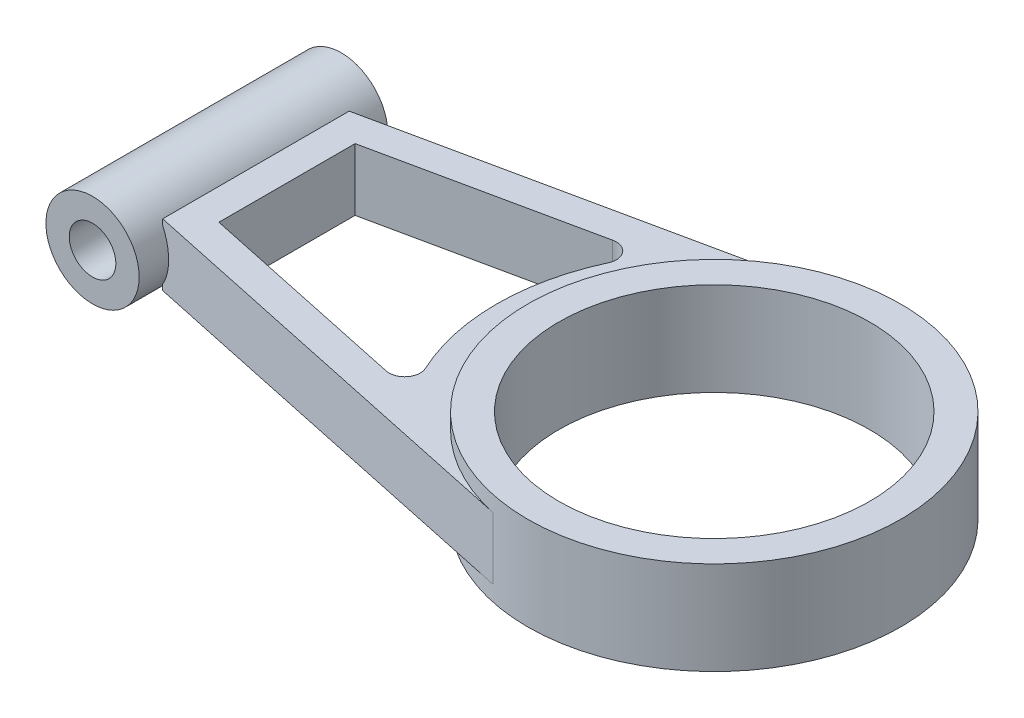
ISO-10303-21;
HEADER;
FILE_DESCRIPTION(('STEP AP214'),'2;1');
FILE_NAME('part.step','',(''),(''),'','','');
FILE_SCHEMA(('AUTOMOTIVE_DESIGN { 1 0 10303 214 1 1 1 1 }'));
ENDSEC;
DATA;
#1=APPLICATION_CONTEXT('core data for automotive mechanical design processes');
#2=APPLICATION_PROTOCOL_DEFINITION('international standard','automotive_design',2000,#1);
#3=PRODUCT_CONTEXT('',#1,'mechanical');
#4=PRODUCT('Part','Part','',(#3));
#5=PRODUCT_RELATED_PRODUCT_CATEGORY('part','',(#4));
#6=PRODUCT_DEFINITION_FORMATION('','',#4);
#7=PRODUCT_DEFINITION_CONTEXT('part definition',#1,'design');
#8=PRODUCT_DEFINITION('design','',#6,#7);
#9=PRODUCT_DEFINITION_SHAPE('','',#8);
#10=(LENGTH_UNIT() NAMED_UNIT(*) SI_UNIT(.MILLI.,.METRE.));
#11=(NAMED_UNIT(*) PLANE_ANGLE_UNIT() SI_UNIT($,.RADIAN.));
#12=(NAMED_UNIT(*) SI_UNIT($,.STERADIAN.) SOLID_ANGLE_UNIT());
#13=UNCERTAINTY_MEASURE_WITH_UNIT(LENGTH_MEASURE(1.E-05),#10,'distance_accuracy_value','');
#14=(GEOMETRIC_REPRESENTATION_CONTEXT(3) GLOBAL_UNCERTAINTY_ASSIGNED_CONTEXT((#13)) GLOBAL_UNIT_ASSIGNED_CONTEXT((#10,
#11,#12)) REPRESENTATION_CONTEXT('',''));
#15=CARTESIAN_POINT('',(0.,0.,0.));
#16=DIRECTION('',(0.,0.,1.));
#17=DIRECTION('',(1.,0.,0.));
#18=AXIS2_PLACEMENT_3D('',#15,#16,#17);
#19=CARTESIAN_POINT('',(-147.445157400294,30.,-30.));
#20=DIRECTION('',(1.,0.,0.));
#21=DIRECTION('',(0.,0.,-1.));
#22=AXIS2_PLACEMENT_3D('',#19,#20,#21);
#23=PLANE('',#22);
#24=DIRECTION('',(0.,-1.,0.));
#25=VECTOR('',#24,1.);
#26=CARTESIAN_POINT('',(-147.445157400294,30.,-30.));
#27=LINE('',#26,#25);
#28=CARTESIAN_POINT('',(-147.445157400294,25.,-30.));
#29=VERTEX_POINT('',#28);
#30=CARTESIAN_POINT('',(-147.445157400294,23.2082840652967,-30.));
#31=VERTEX_POINT('',#30);
#32=EDGE_CURVE('E163',#29,#31,#27,.T.);
#33=ORIENTED_EDGE('',*,*,#32,.T.);
#34=DIRECTION('',(0.,0.,-1.));
#35=VECTOR('',#34,1.);
#36=CARTESIAN_POINT('',(-147.445157400294,23.2082840652967,40.));
#37=LINE('',#36,#35);
#38=CARTESIAN_POINT('',(-147.445157400294,23.2082840652967,30.));
#39=VERTEX_POINT('',#38);
#40=EDGE_CURVE('E144',#39,#31,#37,.T.);
#41=ORIENTED_EDGE('',*,*,#40,.F.);
#42=DIRECTION('',(0.,-1.,0.));
#43=VECTOR('',#42,1.);
#44=CARTESIAN_POINT('',(-147.445157400294,30.,30.));
#45=LINE('',#44,#43);
#46=CARTESIAN_POINT('',(-147.445157400294,25.,30.));
#47=VERTEX_POINT('',#46);
#48=EDGE_CURVE('E164',#47,#39,#45,.T.);
#49=ORIENTED_EDGE('',*,*,#48,.F.);
#50=DIRECTION('',(0.,0.,1.));
#51=VECTOR('',#50,1.);
#52=CARTESIAN_POINT('',(-147.445157400294,25.,-30.));
#53=LINE('',#52,#51);
#54=EDGE_CURVE('E68',#29,#47,#53,.T.);
#55=ORIENTED_EDGE('',*,*,#54,.F.);
#56=EDGE_LOOP('',(#33,#41,#49,#55));
#57=FACE_BOUND('',#56,.T.);
#58=ADVANCED_FACE('F45',(#57),#23,.F.);
#59=DIRECTION('',(0.,0.,-1.));
#60=VECTOR('',#59,1.);
#61=CARTESIAN_POINT('',(-147.445157400294,6.79171593470326,40.));
#62=LINE('',#61,#60);
#63=CARTESIAN_POINT('',(-147.445157400294,6.79171593470327,-30.));
#64=VERTEX_POINT('',#63);
#65=CARTESIAN_POINT('',(-147.445157400294,6.79171593470328,30.));
#66=VERTEX_POINT('',#65);
#67=EDGE_CURVE('E133',#64,#66,#62,.F.);
#68=ORIENTED_EDGE('',*,*,#67,.F.);
#69=CARTESIAN_POINT('',(-147.445157400294,5.,-30.));
#70=VERTEX_POINT('',#69);
#71=EDGE_CURVE('E138',#64,#70,#27,.T.);
#72=ORIENTED_EDGE('',*,*,#71,.T.);
#73=DIRECTION('',(0.,0.,1.));
#74=VECTOR('',#73,1.);
#75=CARTESIAN_POINT('',(-147.445157400294,5.,-30.));
#76=LINE('',#75,#74);
#77=CARTESIAN_POINT('',(-147.445157400294,5.,30.));
#78=VERTEX_POINT('',#77);
#79=EDGE_CURVE('E191',#70,#78,#76,.T.);
#80=ORIENTED_EDGE('',*,*,#79,.T.);
#81=EDGE_CURVE('E140',#66,#78,#45,.T.);
#82=ORIENTED_EDGE('',*,*,#81,.F.);
#83=EDGE_LOOP('',(#68,#72,#80,#82));
#84=FACE_BOUND('',#83,.T.);
#85=ADVANCED_FACE('F135',(#84),#23,.F.);
#86=CARTESIAN_POINT('',(-147.445157400294,30.,-30.));
#87=DIRECTION('',(0.20791169081776,0.,0.978147600733806));
#88=DIRECTION('',(0.978147600733806,0.,-0.20791169081776));
#89=AXIS2_PLACEMENT_3D('',#86,#87,#88);
#90=PLANE('',#89);
#91=ORIENTED_EDGE('',*,*,#71,.F.);
#92=CARTESIAN_POINT('',(-160.,15.,-27.3313858246981));
#93=DIRECTION('',(0.20791169081776,0.,0.978147600733806));
#94=DIRECTION('',(-0.978147600733806,0.,0.20791169081776));
#95=AXIS2_PLACEMENT_3D('',#92,#93,#94);
#96=ELLIPSE('',#95,15.3351089229755,15.);
#97=EDGE_CURVE('E147',#64,#31,#96,.T.);
#98=ORIENTED_EDGE('',*,*,#97,.T.);
#99=ORIENTED_EDGE('',*,*,#32,.F.);
#100=DIRECTION('',(-0.978147600733805,0.,0.20791169081776));
#101=VECTOR('',#100,1.);
#102=CARTESIAN_POINT('',(-12.4747014490656,25.,-58.6888560440283));
#103=LINE('',#102,#101);
#104=CARTESIAN_POINT('',(-12.4747014490656,25.,-58.6888560440283));
#105=VERTEX_POINT('',#104);
#106=EDGE_CURVE('E175',#105,#29,#103,.T.);
#107=ORIENTED_EDGE('',*,*,#106,.F.);
#108=DIRECTION('',(0.,-1.,0.));
#109=VECTOR('',#108,1.);
#110=CARTESIAN_POINT('',(-12.4747014490656,30.,-58.6888560440283));
#111=LINE('',#110,#109);
#112=CARTESIAN_POINT('',(-12.4747014490656,5.,-58.6888560440283));
#113=VERTEX_POINT('',#112);
#114=EDGE_CURVE('E55',#105,#113,#111,.T.);
#115=ORIENTED_EDGE('',*,*,#114,.T.);
#116=DIRECTION('',(-0.978147600733805,0.,0.20791169081776));
#117=VECTOR('',#116,1.);
#118=CARTESIAN_POINT('',(-12.4747014490656,5.,-58.6888560440283));
#119=LINE('',#118,#117);
#120=EDGE_CURVE('E161',#113,#70,#119,.T.);
#121=ORIENTED_EDGE('',*,*,#120,.T.);
#122=EDGE_LOOP('',(#91,#98,#99,#107,#115,#121));
#123=FACE_BOUND('',#122,.T.);
#124=ADVANCED_FACE('F159',(#123),#90,.F.);
#125=CARTESIAN_POINT('',(-147.445157400294,30.,30.));
#126=DIRECTION('',(0.20791169081776,0.,-0.978147600733806));
#127=DIRECTION('',(-0.978147600733806,0.,-0.20791169081776));
#128=AXIS2_PLACEMENT_3D('',#125,#126,#127);
#129=PLANE('',#128);
#130=CARTESIAN_POINT('',(-160.,15.,27.3313858246981));
#131=DIRECTION('',(0.20791169081776,0.,-0.978147600733806));
#132=DIRECTION('',(-0.978147600733806,0.,-0.20791169081776));
#133=AXIS2_PLACEMENT_3D('',#130,#131,#132);
#134=ELLIPSE('',#133,15.3351089229755,15.);
#135=EDGE_CURVE('E11',#66,#39,#134,.F.);
#136=ORIENTED_EDGE('',*,*,#135,.F.);
#137=ORIENTED_EDGE('',*,*,#81,.T.);
#138=DIRECTION('',(0.978147600733805,0.,0.20791169081776));
#139=VECTOR('',#138,1.);
#140=CARTESIAN_POINT('',(-147.445157400294,5.,30.));
#141=LINE('',#140,#139);
#142=CARTESIAN_POINT('',(-12.4747014490656,5.,58.6888560440283));
#143=VERTEX_POINT('',#142);
#144=EDGE_CURVE('E187',#78,#143,#141,.T.);
#145=ORIENTED_EDGE('',*,*,#144,.T.);
#146=DIRECTION('',(0.,-1.,0.));
#147=VECTOR('',#146,1.);
#148=CARTESIAN_POINT('',(-12.4747014490656,30.,58.6888560440283));
#149=LINE('',#148,#147);
#150=CARTESIAN_POINT('',(-12.4747014490656,25.,58.6888560440283));
#151=VERTEX_POINT('',#150);
#152=EDGE_CURVE('E182',#151,#143,#149,.T.);
#153=ORIENTED_EDGE('',*,*,#152,.F.);
#154=DIRECTION('',(0.978147600733805,0.,0.20791169081776));
#155=VECTOR('',#154,1.);
#156=CARTESIAN_POINT('',(-147.445157400294,25.,30.));
#157=LINE('',#156,#155);
#158=EDGE_CURVE('E263',#47,#151,#157,.T.);
#159=ORIENTED_EDGE('',*,*,#158,.F.);
#160=ORIENTED_EDGE('',*,*,#48,.T.);
#161=EDGE_LOOP('',(#136,#137,#145,#153,#159,#160));
#162=FACE_BOUND('',#161,.T.);
#163=ADVANCED_FACE('F231',(#162),#129,.F.);
#164=CARTESIAN_POINT('',(-68.0448821308275,30.,-31.5419405839557));
#165=DIRECTION('',(0.,-1.,0.));
#166=DIRECTION('',(0.,0.,-1.));
#167=AXIS2_PLACEMENT_3D('',#164,#165,#166);
#168=CYLINDRICAL_SURFACE('',#167,5.);
#169=DIRECTION('',(0.,-1.,0.));
#170=VECTOR('',#169,1.);
#171=CARTESIAN_POINT('',(-63.508556655439,30.,-29.4391445450253));
#172=LINE('',#171,#170);
#173=CARTESIAN_POINT('',(-63.508556655439,25.,-29.4391445450253));
#174=VERTEX_POINT('',#173);
#175=CARTESIAN_POINT('',(-63.508556655439,5.,-29.4391445450253));
#176=VERTEX_POINT('',#175);
#177=EDGE_CURVE('E203',#174,#176,#172,.T.);
#178=ORIENTED_EDGE('',*,*,#177,.F.);
#179=CARTESIAN_POINT('',(-68.0448821308275,25.,-31.5419405839557));
#180=DIRECTION('',(0.,1.,0.));
#181=DIRECTION('',(0.,0.,1.));
#182=AXIS2_PLACEMENT_3D('',#179,#180,#181);
#183=CIRCLE('',#182,5.);
#184=CARTESIAN_POINT('',(-69.0844405849164,25.,-36.4326785876247));
#185=VERTEX_POINT('',#184);
#186=EDGE_CURVE('E274',#174,#185,#183,.T.);
#187=ORIENTED_EDGE('',*,*,#186,.T.);
#188=DIRECTION('',(0.,-1.,0.));
#189=VECTOR('',#188,1.);
#190=CARTESIAN_POINT('',(-69.0844405849164,30.,-36.4326785876247));
#191=LINE('',#190,#189);
#192=CARTESIAN_POINT('',(-69.0844405849164,5.,-36.4326785876247));
#193=VERTEX_POINT('',#192);
#194=EDGE_CURVE('E219',#185,#193,#191,.T.);
#195=ORIENTED_EDGE('',*,*,#194,.T.);
#196=CARTESIAN_POINT('',(-68.0448821308275,5.,-31.5419405839557));
#197=DIRECTION('',(0.,1.,0.));
#198=DIRECTION('',(0.,0.,1.));
#199=AXIS2_PLACEMENT_3D('',#196,#197,#198);
#200=CIRCLE('',#199,5.);
#201=EDGE_CURVE('E256',#176,#193,#200,.T.);
#202=ORIENTED_EDGE('',*,*,#201,.F.);
#203=EDGE_LOOP('',(#178,#187,#195,#202));
#204=FACE_BOUND('',#203,.T.);
#205=ADVANCED_FACE('F334',(#204),#168,.F.);
#206=CARTESIAN_POINT('',(-137.445157400294,30.,-21.9021596680499));
#207=DIRECTION('',(0.20791169081776,0.,0.978147600733806));
#208=DIRECTION('',(0.978147600733806,0.,-0.20791169081776));
#209=AXIS2_PLACEMENT_3D('',#206,#207,#208);
#210=PLANE('',#209);
#211=ORIENTED_EDGE('',*,*,#194,.F.);
#212=DIRECTION('',(-0.978147600733805,0.,0.20791169081776));
#213=VECTOR('',#212,1.);
#214=CARTESIAN_POINT('',(-69.0844405849164,25.,-36.4326785876247));
#215=LINE('',#214,#213);
#216=CARTESIAN_POINT('',(-137.445157400294,25.,-21.9021596680499));
#217=VERTEX_POINT('',#216);
#218=EDGE_CURVE('E270',#185,#217,#215,.T.);
#219=ORIENTED_EDGE('',*,*,#218,.T.);
#220=DIRECTION('',(0.,-1.,0.));
#221=VECTOR('',#220,1.);
#222=CARTESIAN_POINT('',(-137.445157400294,30.,-21.9021596680499));
#223=LINE('',#222,#221);
#224=CARTESIAN_POINT('',(-137.445157400294,5.,-21.9021596680499));
#225=VERTEX_POINT('',#224);
#226=EDGE_CURVE('E216',#217,#225,#223,.T.);
#227=ORIENTED_EDGE('',*,*,#226,.T.);
#228=DIRECTION('',(-0.978147600733805,0.,0.20791169081776));
#229=VECTOR('',#228,1.);
#230=CARTESIAN_POINT('',(-69.0844405849164,5.,-36.4326785876247));
#231=LINE('',#230,#229);
#232=EDGE_CURVE('E252',#193,#225,#231,.T.);
#233=ORIENTED_EDGE('',*,*,#232,.F.);
#234=EDGE_LOOP('',(#211,#219,#227,#233));
#235=FACE_BOUND('',#234,.T.);
#236=ADVANCED_FACE('F339',(#235),#210,.T.);
#237=CARTESIAN_POINT('',(-137.445157400294,30.,-21.9021596680499));
#238=DIRECTION('',(1.,0.,0.));
#239=DIRECTION('',(0.,0.,-1.));
#240=AXIS2_PLACEMENT_3D('',#237,#238,#239);
#241=PLANE('',#240);
#242=ORIENTED_EDGE('',*,*,#226,.F.);
#243=DIRECTION('',(0.,0.,1.));
#244=VECTOR('',#243,1.);
#245=CARTESIAN_POINT('',(-137.445157400294,25.,-21.9021596680499));
#246=LINE('',#245,#244);
#247=CARTESIAN_POINT('',(-137.445157400294,25.,21.9021596680499));
#248=VERTEX_POINT('',#247);
#249=EDGE_CURVE('E143',#217,#248,#246,.T.);
#250=ORIENTED_EDGE('',*,*,#249,.T.);
#251=DIRECTION('',(0.,-1.,0.));
#252=VECTOR('',#251,1.);
#253=CARTESIAN_POINT('',(-137.445157400294,30.,21.9021596680499));
#254=LINE('',#253,#252);
#255=CARTESIAN_POINT('',(-137.445157400294,5.,21.9021596680499));
#256=VERTEX_POINT('',#255);
#257=EDGE_CURVE('E213',#248,#256,#254,.T.);
#258=ORIENTED_EDGE('',*,*,#257,.T.);
#259=DIRECTION('',(0.,0.,1.));
#260=VECTOR('',#259,1.);
#261=CARTESIAN_POINT('',(-137.445157400294,5.,-21.9021596680499));
#262=LINE('',#261,#260);
#263=EDGE_CURVE('E248',#225,#256,#262,.T.);
#264=ORIENTED_EDGE('',*,*,#263,.F.);
#265=EDGE_LOOP('',(#242,#250,#258,#264));
#266=FACE_BOUND('',#265,.T.);
#267=ADVANCED_FACE('F346',(#266),#241,.T.);
#268=CARTESIAN_POINT('',(-137.445157400294,30.,21.9021596680499));
#269=DIRECTION('',(0.20791169081776,0.,-0.978147600733806));
#270=DIRECTION('',(-0.978147600733806,0.,-0.20791169081776));
#271=AXIS2_PLACEMENT_3D('',#268,#269,#270);
#272=PLANE('',#271);
#273=ORIENTED_EDGE('',*,*,#257,.F.);
#274=DIRECTION('',(0.978147600733806,0.,0.20791169081776));
#275=VECTOR('',#274,1.);
#276=CARTESIAN_POINT('',(-137.445157400294,25.,21.9021596680499));
#277=LINE('',#276,#275);
#278=CARTESIAN_POINT('',(-69.0844405849163,25.,36.4326785876247));
#279=VERTEX_POINT('',#278);
#280=EDGE_CURVE('E286',#248,#279,#277,.T.);
#281=ORIENTED_EDGE('',*,*,#280,.T.);
#282=DIRECTION('',(0.,-1.,0.));
#283=VECTOR('',#282,1.);
#284=CARTESIAN_POINT('',(-69.0844405849163,30.,36.4326785876247));
#285=LINE('',#284,#283);
#286=CARTESIAN_POINT('',(-69.0844405849163,5.,36.4326785876247));
#287=VERTEX_POINT('',#286);
#288=EDGE_CURVE('E210',#279,#287,#285,.T.);
#289=ORIENTED_EDGE('',*,*,#288,.T.);
#290=DIRECTION('',(0.978147600733806,0.,0.20791169081776));
#291=VECTOR('',#290,1.);
#292=CARTESIAN_POINT('',(-137.445157400294,5.,21.9021596680499));
#293=LINE('',#292,#291);
#294=EDGE_CURVE('E244',#256,#287,#293,.T.);
#295=ORIENTED_EDGE('',*,*,#294,.F.);
#296=EDGE_LOOP('',(#273,#281,#289,#295));
#297=FACE_BOUND('',#296,.T.);
#298=ADVANCED_FACE('F386',(#297),#272,.T.);
#299=CARTESIAN_POINT('',(-68.0448821308275,30.,31.5419405839557));
#300=DIRECTION('',(0.,-1.,0.));
#301=DIRECTION('',(0.,0.,-1.));
#302=AXIS2_PLACEMENT_3D('',#299,#300,#301);
#303=CYLINDRICAL_SURFACE('',#302,5.);
#304=ORIENTED_EDGE('',*,*,#288,.F.);
#305=CARTESIAN_POINT('',(-68.0448821308275,25.,31.5419405839557));
#306=DIRECTION('',(0.,1.,0.));
#307=DIRECTION('',(0.,0.,1.));
#308=AXIS2_PLACEMENT_3D('',#305,#306,#307);
#309=CIRCLE('',#308,5.);
#310=CARTESIAN_POINT('',(-63.508556655439,25.,29.4391445450253));
#311=VERTEX_POINT('',#310);
#312=EDGE_CURVE('E282',#279,#311,#309,.T.);
#313=ORIENTED_EDGE('',*,*,#312,.T.);
#314=DIRECTION('',(0.,-1.,0.));
#315=VECTOR('',#314,1.);
#316=CARTESIAN_POINT('',(-63.508556655439,30.,29.4391445450253));
#317=LINE('',#316,#315);
#318=CARTESIAN_POINT('',(-63.508556655439,5.,29.4391445450253));
#319=VERTEX_POINT('',#318);
#320=EDGE_CURVE('E207',#311,#319,#317,.T.);
#321=ORIENTED_EDGE('',*,*,#320,.T.);
#322=CARTESIAN_POINT('',(-68.0448821308275,5.,31.5419405839557));
#323=DIRECTION('',(0.,1.,0.));
#324=DIRECTION('',(0.,0.,1.));
#325=AXIS2_PLACEMENT_3D('',#322,#323,#324);
#326=CIRCLE('',#325,5.);
#327=EDGE_CURVE('E238',#287,#319,#326,.T.);
#328=ORIENTED_EDGE('',*,*,#327,.F.);
#329=EDGE_LOOP('',(#304,#313,#321,#328));
#330=FACE_BOUND('',#329,.T.);
#331=ADVANCED_FACE('F363',(#330),#303,.F.);
#332=CARTESIAN_POINT('',(0.,30.,0.));
#333=DIRECTION('',(0.,-1.,0.));
#334=DIRECTION('',(0.,0.,-1.));
#335=AXIS2_PLACEMENT_3D('',#332,#333,#334);
#336=CYLINDRICAL_SURFACE('',#335,70.);
#337=ORIENTED_EDGE('',*,*,#320,.F.);
#338=CARTESIAN_POINT('',(0.,25.,0.));
#339=DIRECTION('',(0.,-1.,0.));
#340=DIRECTION('',(0.,0.,1.));
#341=AXIS2_PLACEMENT_3D('',#338,#339,#340);
#342=CIRCLE('',#341,70.);
#343=EDGE_CURVE('E278',#311,#174,#342,.T.);
#344=ORIENTED_EDGE('',*,*,#343,.T.);
#345=ORIENTED_EDGE('',*,*,#177,.T.);
#346=CARTESIAN_POINT('',(0.,5.,0.));
#347=DIRECTION('',(0.,-1.,0.));
#348=DIRECTION('',(0.,0.,1.));
#349=AXIS2_PLACEMENT_3D('',#346,#347,#348);
#350=CIRCLE('',#349,70.);
#351=EDGE_CURVE('E234',#319,#176,#350,.T.);
#352=ORIENTED_EDGE('',*,*,#351,.F.);
#353=EDGE_LOOP('',(#337,#344,#345,#352));
#354=FACE_BOUND('',#353,.T.);
#355=ADVANCED_FACE('F357',(#354),#336,.T.);
#356=CARTESIAN_POINT('',(0.,0.,0.));
#357=DIRECTION('',(0.,1.,0.));
#358=DIRECTION('',(0.,0.,1.));
#359=AXIS2_PLACEMENT_3D('',#356,#357,#358);
#360=PLANE('',#359);
#361=CARTESIAN_POINT('',(0.,0.,0.));
#362=DIRECTION('',(0.,1.,0.));
#363=DIRECTION('',(0.,0.,1.));
#364=AXIS2_PLACEMENT_3D('',#361,#362,#363);
#365=CIRCLE('',#364,50.);
#366=CARTESIAN_POINT('',(0.,0.,50.));
#367=VERTEX_POINT('',#366);
#368=EDGE_CURVE('E193',#367,#367,#365,.T.);
#369=ORIENTED_EDGE('',*,*,#368,.T.);
#370=EDGE_LOOP('',(#369));
#371=FACE_BOUND('',#370,.T.);
#372=CARTESIAN_POINT('',(0.,0.,0.));
#373=DIRECTION('',(0.,1.,0.));
#374=DIRECTION('',(0.,0.,1.));
#375=AXIS2_PLACEMENT_3D('',#372,#373,#374);
#376=CIRCLE('',#375,60.);
#377=CARTESIAN_POINT('',(0.,0.,60.));
#378=VERTEX_POINT('',#377);
#379=EDGE_CURVE('E222',#378,#378,#376,.T.);
#380=ORIENTED_EDGE('',*,*,#379,.F.);
#381=EDGE_LOOP('',(#380));
#382=FACE_BOUND('',#381,.T.);
#383=ADVANCED_FACE('F354',(#371,#382),#360,.F.);
#384=CARTESIAN_POINT('',(0.,30.,0.));
#385=DIRECTION('',(0.,1.,0.));
#386=DIRECTION('',(0.,0.,1.));
#387=AXIS2_PLACEMENT_3D('',#384,#385,#386);
#388=PLANE('',#387);
#389=CARTESIAN_POINT('',(0.,30.,0.));
#390=DIRECTION('',(0.,1.,0.));
#391=DIRECTION('',(0.,0.,1.));
#392=AXIS2_PLACEMENT_3D('',#389,#390,#391);
#393=CIRCLE('',#392,60.);
#394=CARTESIAN_POINT('',(0.,30.,60.));
#395=VERTEX_POINT('',#394);
#396=EDGE_CURVE('E223',#395,#395,#393,.T.);
#397=ORIENTED_EDGE('',*,*,#396,.T.);
#398=EDGE_LOOP('',(#397));
#399=FACE_BOUND('',#398,.T.);
#400=CARTESIAN_POINT('',(0.,30.,0.));
#401=DIRECTION('',(0.,1.,0.));
#402=DIRECTION('',(0.,0.,1.));
#403=AXIS2_PLACEMENT_3D('',#400,#401,#402);
#404=CIRCLE('',#403,50.);
#405=CARTESIAN_POINT('',(0.,30.,50.));
#406=VERTEX_POINT('',#405);
#407=EDGE_CURVE('E197',#406,#406,#404,.T.);
#408=ORIENTED_EDGE('',*,*,#407,.F.);
#409=EDGE_LOOP('',(#408));
#410=FACE_BOUND('',#409,.T.);
#411=ADVANCED_FACE('F352',(#399,#410),#388,.T.);
#412=CARTESIAN_POINT('',(0.,30.,0.));
#413=DIRECTION('',(0.,-1.,0.));
#414=DIRECTION('',(0.,0.,-1.));
#415=AXIS2_PLACEMENT_3D('',#412,#413,#414);
#416=CYLINDRICAL_SURFACE('',#415,60.);
#417=ORIENTED_EDGE('',*,*,#114,.F.);
#418=CARTESIAN_POINT('',(0.,25.,0.));
#419=DIRECTION('',(0.,-1.,0.));
#420=DIRECTION('',(0.,0.,1.));
#421=AXIS2_PLACEMENT_3D('',#418,#419,#420);
#422=CIRCLE('',#421,60.);
#423=EDGE_CURVE('E260',#151,#105,#422,.T.);
#424=ORIENTED_EDGE('',*,*,#423,.F.);
#425=ORIENTED_EDGE('',*,*,#152,.T.);
#426=CARTESIAN_POINT('',(0.,5.,0.));
#427=DIRECTION('',(0.,-1.,0.));
#428=DIRECTION('',(0.,0.,1.));
#429=AXIS2_PLACEMENT_3D('',#426,#427,#428);
#430=CIRCLE('',#429,60.);
#431=EDGE_CURVE('E179',#143,#113,#430,.T.);
#432=ORIENTED_EDGE('',*,*,#431,.T.);
#433=EDGE_LOOP('',(#417,#424,#425,#432));
#434=FACE_BOUND('',#433,.T.);
#435=ORIENTED_EDGE('',*,*,#379,.T.);
#436=EDGE_LOOP('',(#435));
#437=FACE_BOUND('',#436,.T.);
#438=ORIENTED_EDGE('',*,*,#396,.F.);
#439=EDGE_LOOP('',(#438));
#440=FACE_BOUND('',#439,.T.);
#441=ADVANCED_FACE('F47',(#434,#437,#440),#416,.T.);
#442=CARTESIAN_POINT('',(0.,30.,0.));
#443=DIRECTION('',(0.,-1.,0.));
#444=DIRECTION('',(0.,0.,-1.));
#445=AXIS2_PLACEMENT_3D('',#442,#443,#444);
#446=CYLINDRICAL_SURFACE('',#445,50.);
#447=ORIENTED_EDGE('',*,*,#407,.T.);
#448=EDGE_LOOP('',(#447));
#449=FACE_BOUND('',#448,.T.);
#450=ORIENTED_EDGE('',*,*,#368,.F.);
#451=EDGE_LOOP('',(#450));
#452=FACE_BOUND('',#451,.T.);
#453=ADVANCED_FACE('F371',(#449,#452),#446,.F.);
#454=CARTESIAN_POINT('',(0.,5.,0.));
#455=DIRECTION('',(0.,1.,0.));
#456=DIRECTION('',(0.,0.,1.));
#457=AXIS2_PLACEMENT_3D('',#454,#455,#456);
#458=PLANE('',#457);
#459=ORIENTED_EDGE('',*,*,#79,.F.);
#460=ORIENTED_EDGE('',*,*,#120,.F.);
#461=ORIENTED_EDGE('',*,*,#431,.F.);
#462=ORIENTED_EDGE('',*,*,#144,.F.);
#463=EDGE_LOOP('',(#459,#460,#461,#462));
#464=FACE_BOUND('',#463,.T.);
#465=ORIENTED_EDGE('',*,*,#232,.T.);
#466=ORIENTED_EDGE('',*,*,#263,.T.);
#467=ORIENTED_EDGE('',*,*,#294,.T.);
#468=ORIENTED_EDGE('',*,*,#327,.T.);
#469=ORIENTED_EDGE('',*,*,#351,.T.);
#470=ORIENTED_EDGE('',*,*,#201,.T.);
#471=EDGE_LOOP('',(#465,#466,#467,#468,#469,#470));
#472=FACE_BOUND('',#471,.T.);
#473=ADVANCED_FACE('F189',(#464,#472),#458,.F.);
#474=CARTESIAN_POINT('',(0.,25.,0.));
#475=DIRECTION('',(0.,1.,0.));
#476=DIRECTION('',(0.,0.,1.));
#477=AXIS2_PLACEMENT_3D('',#474,#475,#476);
#478=PLANE('',#477);
#479=ORIENTED_EDGE('',*,*,#218,.F.);
#480=ORIENTED_EDGE('',*,*,#186,.F.);
#481=ORIENTED_EDGE('',*,*,#343,.F.);
#482=ORIENTED_EDGE('',*,*,#312,.F.);
#483=ORIENTED_EDGE('',*,*,#280,.F.);
#484=ORIENTED_EDGE('',*,*,#249,.F.);
#485=EDGE_LOOP('',(#479,#480,#481,#482,#483,#484));
#486=FACE_BOUND('',#485,.T.);
#487=ORIENTED_EDGE('',*,*,#106,.T.);
#488=ORIENTED_EDGE('',*,*,#54,.T.);
#489=ORIENTED_EDGE('',*,*,#158,.T.);
#490=ORIENTED_EDGE('',*,*,#423,.T.);
#491=EDGE_LOOP('',(#487,#488,#489,#490));
#492=FACE_BOUND('',#491,.T.);
#493=ADVANCED_FACE('F380',(#486,#492),#478,.T.);
#494=CARTESIAN_POINT('',(-160.,15.,40.));
#495=DIRECTION('',(0.,0.,-1.));
#496=DIRECTION('',(-1.,0.,0.));
#497=AXIS2_PLACEMENT_3D('',#494,#495,#496);
#498=CYLINDRICAL_SURFACE('',#497,15.);
#499=CARTESIAN_POINT('',(-160.,15.,40.));
#500=DIRECTION('',(0.,0.,1.));
#501=DIRECTION('',(1.,0.,0.));
#502=AXIS2_PLACEMENT_3D('',#499,#500,#501);
#503=CIRCLE('',#502,15.);
#504=CARTESIAN_POINT('',(-145.,15.,40.));
#505=VERTEX_POINT('',#504);
#506=EDGE_CURVE('E155',#505,#505,#503,.T.);
#507=ORIENTED_EDGE('',*,*,#506,.F.);
#508=EDGE_LOOP('',(#507));
#509=FACE_BOUND('',#508,.T.);
#510=ORIENTED_EDGE('',*,*,#40,.T.);
#511=ORIENTED_EDGE('',*,*,#97,.F.);
#512=ORIENTED_EDGE('',*,*,#67,.T.);
#513=ORIENTED_EDGE('',*,*,#135,.T.);
#514=EDGE_LOOP('',(#510,#511,#512,#513));
#515=FACE_BOUND('',#514,.T.);
#516=CARTESIAN_POINT('',(-160.,15.,-40.));
#517=DIRECTION('',(0.,0.,1.));
#518=DIRECTION('',(1.,0.,0.));
#519=AXIS2_PLACEMENT_3D('',#516,#517,#518);
#520=CIRCLE('',#519,15.);
#521=CARTESIAN_POINT('',(-145.,15.,-40.));
#522=VERTEX_POINT('',#521);
#523=EDGE_CURVE('E156',#522,#522,#520,.T.);
#524=ORIENTED_EDGE('',*,*,#523,.T.);
#525=EDGE_LOOP('',(#524));
#526=FACE_BOUND('',#525,.T.);
#527=ADVANCED_FACE('F148',(#509,#515,#526),#498,.T.);
#528=CARTESIAN_POINT('',(-160.,15.,40.));
#529=DIRECTION('',(0.,0.,1.));
#530=DIRECTION('',(1.,0.,0.));
#531=AXIS2_PLACEMENT_3D('',#528,#529,#530);
#532=PLANE('',#531);
#533=CARTESIAN_POINT('',(-160.,15.,40.));
#534=DIRECTION('',(0.,0.,1.));
#535=DIRECTION('',(1.,0.,0.));
#536=AXIS2_PLACEMENT_3D('',#533,#534,#535);
#537=CIRCLE('',#536,7.50000000000001);
#538=CARTESIAN_POINT('',(-152.5,15.,40.));
#539=VERTEX_POINT('',#538);
#540=EDGE_CURVE('E301',#539,#539,#537,.T.);
#541=ORIENTED_EDGE('',*,*,#540,.F.);
#542=EDGE_LOOP('',(#541));
#543=FACE_BOUND('',#542,.T.);
#544=ORIENTED_EDGE('',*,*,#506,.T.);
#545=EDGE_LOOP('',(#544));
#546=FACE_BOUND('',#545,.T.);
#547=ADVANCED_FACE('F319',(#543,#546),#532,.T.);
#548=CARTESIAN_POINT('',(-160.,15.,-40.));
#549=DIRECTION('',(0.,0.,1.));
#550=DIRECTION('',(1.,0.,0.));
#551=AXIS2_PLACEMENT_3D('',#548,#549,#550);
#552=PLANE('',#551);
#553=CARTESIAN_POINT('',(-160.,15.,-40.));
#554=DIRECTION('',(0.,0.,1.));
#555=DIRECTION('',(1.,0.,0.));
#556=AXIS2_PLACEMENT_3D('',#553,#554,#555);
#557=CIRCLE('',#556,7.50000000000001);
#558=CARTESIAN_POINT('',(-152.5,15.,-40.));
#559=VERTEX_POINT('',#558);
#560=EDGE_CURVE('E49',#559,#559,#557,.T.);
#561=ORIENTED_EDGE('',*,*,#560,.T.);
#562=EDGE_LOOP('',(#561));
#563=FACE_BOUND('',#562,.T.);
#564=ORIENTED_EDGE('',*,*,#523,.F.);
#565=EDGE_LOOP('',(#564));
#566=FACE_BOUND('',#565,.T.);
#567=ADVANCED_FACE('F310',(#563,#566),#552,.F.);
#568=CARTESIAN_POINT('',(-160.,15.,-60.));
#569=DIRECTION('',(0.,0.,1.));
#570=DIRECTION('',(1.,0.,0.));
#571=AXIS2_PLACEMENT_3D('',#568,#569,#570);
#572=CYLINDRICAL_SURFACE('',#571,7.50000000000001);
#573=ORIENTED_EDGE('',*,*,#540,.T.);
#574=EDGE_LOOP('',(#573));
#575=FACE_BOUND('',#574,.T.);
#576=ORIENTED_EDGE('',*,*,#560,.F.);
#577=EDGE_LOOP('',(#576));
#578=FACE_BOUND('',#577,.T.);
#579=ADVANCED_FACE('F313',(#575,#578),#572,.F.);
#580=CLOSED_SHELL('',(#58,#85,#124,#163,#205,#236,#267,#298,#331,#355,#383,#411,#441,#453,#473,
#493,#527,#547,#567,#579));
#581=MANIFOLD_SOLID_BREP('B2',#580);
#582=ADVANCED_BREP_SHAPE_REPRESENTATION('',(#18,#581),#14);
#583=SHAPE_DEFINITION_REPRESENTATION(#9,#582);
ENDSEC;
END-ISO-10303-21;
